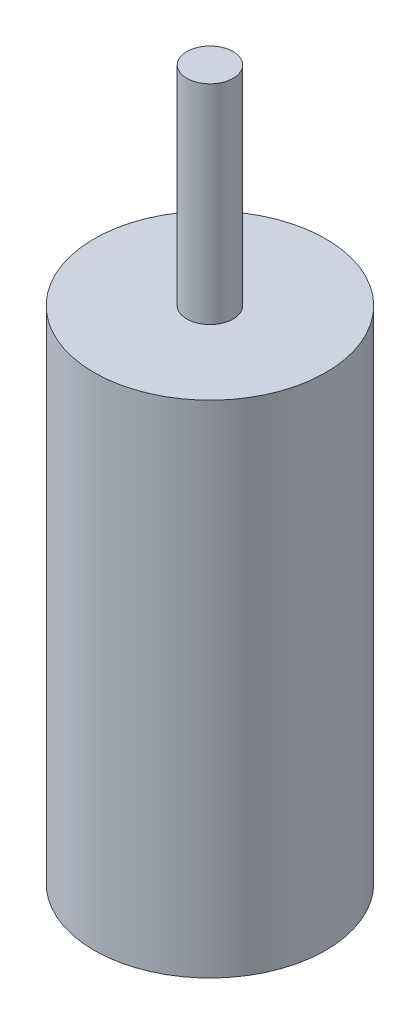
ISO-10303-21;
HEADER;
FILE_DESCRIPTION(('STEP AP214'),'2;1');
FILE_NAME('part.step','',(''),(''),'','','');
FILE_SCHEMA(('AUTOMOTIVE_DESIGN { 1 0 10303 214 1 1 1 1 }'));
ENDSEC;
DATA;
#1=APPLICATION_CONTEXT('core data for automotive mechanical design processes');
#2=APPLICATION_PROTOCOL_DEFINITION('international standard','automotive_design',2000,#1);
#3=PRODUCT_CONTEXT('',#1,'mechanical');
#4=PRODUCT('Part','Part','',(#3));
#5=PRODUCT_RELATED_PRODUCT_CATEGORY('part','',(#4));
#6=PRODUCT_DEFINITION_FORMATION('','',#4);
#7=PRODUCT_DEFINITION_CONTEXT('part definition',#1,'design');
#8=PRODUCT_DEFINITION('design','',#6,#7);
#9=PRODUCT_DEFINITION_SHAPE('','',#8);
#10=(LENGTH_UNIT() NAMED_UNIT(*) SI_UNIT(.MILLI.,.METRE.));
#11=(NAMED_UNIT(*) PLANE_ANGLE_UNIT() SI_UNIT($,.RADIAN.));
#12=(NAMED_UNIT(*) SI_UNIT($,.STERADIAN.) SOLID_ANGLE_UNIT());
#13=UNCERTAINTY_MEASURE_WITH_UNIT(LENGTH_MEASURE(1.E-05),#10,'distance_accuracy_value','');
#14=(GEOMETRIC_REPRESENTATION_CONTEXT(3) GLOBAL_UNCERTAINTY_ASSIGNED_CONTEXT((#13)) GLOBAL_UNIT_ASSIGNED_CONTEXT((#10,
#11,#12)) REPRESENTATION_CONTEXT('',''));
#15=CARTESIAN_POINT('',(0.,0.,0.));
#16=DIRECTION('',(0.,0.,1.));
#17=DIRECTION('',(1.,0.,0.));
#18=AXIS2_PLACEMENT_3D('',#15,#16,#17);
#19=CARTESIAN_POINT('',(0.,43.2,0.));
#20=DIRECTION('',(0.,-1.,0.));
#21=DIRECTION('',(0.,0.,-1.));
#22=AXIS2_PLACEMENT_3D('',#19,#20,#21);
#23=CYLINDRICAL_SURFACE('',#22,10.);
#24=CARTESIAN_POINT('',(0.,43.2,0.));
#25=DIRECTION('',(0.,1.,0.));
#26=DIRECTION('',(0.,0.,1.));
#27=AXIS2_PLACEMENT_3D('',#24,#25,#26);
#28=CIRCLE('',#27,10.);
#29=CARTESIAN_POINT('',(0.,43.2,10.));
#30=VERTEX_POINT('',#29);
#31=EDGE_CURVE('E38',#30,#30,#28,.T.);
#32=ORIENTED_EDGE('',*,*,#31,.F.);
#33=EDGE_LOOP('',(#32));
#34=FACE_BOUND('',#33,.T.);
#35=CARTESIAN_POINT('',(0.,0.,0.));
#36=DIRECTION('',(0.,1.,0.));
#37=DIRECTION('',(0.,0.,1.));
#38=AXIS2_PLACEMENT_3D('',#35,#36,#37);
#39=CIRCLE('',#38,10.);
#40=CARTESIAN_POINT('',(0.,0.,10.));
#41=VERTEX_POINT('',#40);
#42=EDGE_CURVE('E34',#41,#41,#39,.T.);
#43=ORIENTED_EDGE('',*,*,#42,.T.);
#44=EDGE_LOOP('',(#43));
#45=FACE_BOUND('',#44,.T.);
#46=ADVANCED_FACE('F31',(#34,#45),#23,.T.);
#47=CARTESIAN_POINT('',(0.,43.2,0.));
#48=DIRECTION('',(0.,1.,0.));
#49=DIRECTION('',(0.,0.,1.));
#50=AXIS2_PLACEMENT_3D('',#47,#48,#49);
#51=PLANE('',#50);
#52=CARTESIAN_POINT('',(0.,43.2,0.));
#53=DIRECTION('',(0.,1.,0.));
#54=DIRECTION('',(0.,0.,1.));
#55=AXIS2_PLACEMENT_3D('',#52,#53,#54);
#56=CIRCLE('',#55,2.);
#57=CARTESIAN_POINT('',(0.,43.2,2.));
#58=VERTEX_POINT('',#57);
#59=EDGE_CURVE('E10',#58,#58,#56,.T.);
#60=ORIENTED_EDGE('',*,*,#59,.F.);
#61=EDGE_LOOP('',(#60));
#62=FACE_BOUND('',#61,.T.);
#63=ORIENTED_EDGE('',*,*,#31,.T.);
#64=EDGE_LOOP('',(#63));
#65=FACE_BOUND('',#64,.T.);
#66=ADVANCED_FACE('F55',(#62,#65),#51,.T.);
#67=CARTESIAN_POINT('',(0.,0.,0.));
#68=DIRECTION('',(0.,1.,0.));
#69=DIRECTION('',(0.,0.,1.));
#70=AXIS2_PLACEMENT_3D('',#67,#68,#69);
#71=PLANE('',#70);
#72=ORIENTED_EDGE('',*,*,#42,.F.);
#73=EDGE_LOOP('',(#72));
#74=FACE_BOUND('',#73,.T.);
#75=ADVANCED_FACE('F52',(#74),#71,.F.);
#76=CARTESIAN_POINT('',(0.,61.2,0.));
#77=DIRECTION('',(0.,-1.,0.));
#78=DIRECTION('',(0.,0.,-1.));
#79=AXIS2_PLACEMENT_3D('',#76,#77,#78);
#80=CYLINDRICAL_SURFACE('',#79,2.);
#81=CARTESIAN_POINT('',(0.,61.2,0.));
#82=DIRECTION('',(0.,1.,0.));
#83=DIRECTION('',(0.,0.,1.));
#84=AXIS2_PLACEMENT_3D('',#81,#82,#83);
#85=CIRCLE('',#84,2.);
#86=CARTESIAN_POINT('',(0.,61.2,2.));
#87=VERTEX_POINT('',#86);
#88=EDGE_CURVE('E44',#87,#87,#85,.T.);
#89=ORIENTED_EDGE('',*,*,#88,.F.);
#90=EDGE_LOOP('',(#89));
#91=FACE_BOUND('',#90,.T.);
#92=ORIENTED_EDGE('',*,*,#59,.T.);
#93=EDGE_LOOP('',(#92));
#94=FACE_BOUND('',#93,.T.);
#95=ADVANCED_FACE('F54',(#91,#94),#80,.T.);
#96=CARTESIAN_POINT('',(0.,61.2,0.));
#97=DIRECTION('',(0.,1.,0.));
#98=DIRECTION('',(0.,0.,1.));
#99=AXIS2_PLACEMENT_3D('',#96,#97,#98);
#100=PLANE('',#99);
#101=ORIENTED_EDGE('',*,*,#88,.T.);
#102=EDGE_LOOP('',(#101));
#103=FACE_BOUND('',#102,.T.);
#104=ADVANCED_FACE('F60',(#103),#100,.T.);
#105=CLOSED_SHELL('',(#46,#66,#75,#95,#104));
#106=MANIFOLD_SOLID_BREP('B2',#105);
#107=ADVANCED_BREP_SHAPE_REPRESENTATION('',(#18,#106),#14);
#108=SHAPE_DEFINITION_REPRESENTATION(#9,#107);
ENDSEC;
END-ISO-10303-21;
